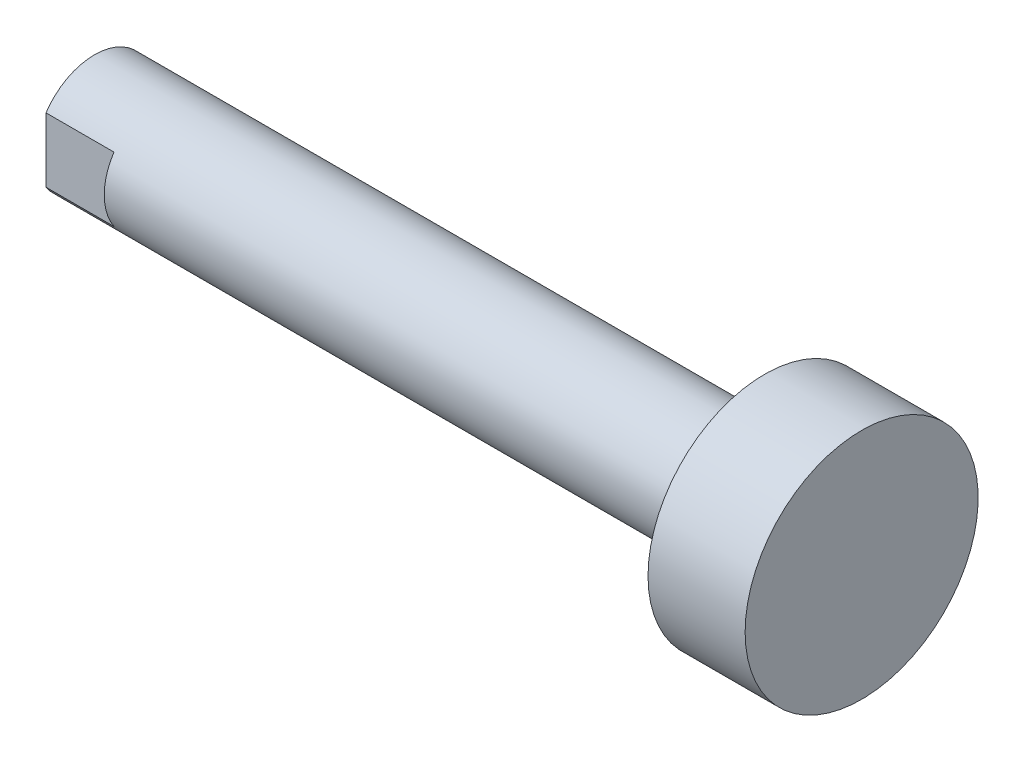
ISO-10303-21;
HEADER;
FILE_DESCRIPTION(('STEP AP214'),'2;1');
FILE_NAME('part.step','',(''),(''),'','','');
FILE_SCHEMA(('AUTOMOTIVE_DESIGN { 1 0 10303 214 1 1 1 1 }'));
ENDSEC;
DATA;
#1=APPLICATION_CONTEXT('core data for automotive mechanical design processes');
#2=APPLICATION_PROTOCOL_DEFINITION('international standard','automotive_design',2000,#1);
#3=PRODUCT_CONTEXT('',#1,'mechanical');
#4=PRODUCT('Part','Part','',(#3));
#5=PRODUCT_RELATED_PRODUCT_CATEGORY('part','',(#4));
#6=PRODUCT_DEFINITION_FORMATION('','',#4);
#7=PRODUCT_DEFINITION_CONTEXT('part definition',#1,'design');
#8=PRODUCT_DEFINITION('design','',#6,#7);
#9=PRODUCT_DEFINITION_SHAPE('','',#8);
#10=(LENGTH_UNIT() NAMED_UNIT(*) SI_UNIT(.MILLI.,.METRE.));
#11=(NAMED_UNIT(*) PLANE_ANGLE_UNIT() SI_UNIT($,.RADIAN.));
#12=(NAMED_UNIT(*) SI_UNIT($,.STERADIAN.) SOLID_ANGLE_UNIT());
#13=UNCERTAINTY_MEASURE_WITH_UNIT(LENGTH_MEASURE(1.E-05),#10,'distance_accuracy_value','');
#14=(GEOMETRIC_REPRESENTATION_CONTEXT(3) GLOBAL_UNCERTAINTY_ASSIGNED_CONTEXT((#13)) GLOBAL_UNIT_ASSIGNED_CONTEXT((#10,
#11,#12)) REPRESENTATION_CONTEXT('',''));
#15=CARTESIAN_POINT('',(0.,0.,0.));
#16=DIRECTION('',(0.,0.,1.));
#17=DIRECTION('',(1.,0.,0.));
#18=AXIS2_PLACEMENT_3D('',#15,#16,#17);
#19=CARTESIAN_POINT('',(36.,0.,0.));
#20=DIRECTION('',(-1.,0.,0.));
#21=DIRECTION('',(0.,0.,1.));
#22=AXIS2_PLACEMENT_3D('',#19,#20,#21);
#23=CYLINDRICAL_SURFACE('',#22,6.);
#24=CARTESIAN_POINT('',(36.,0.,0.));
#25=DIRECTION('',(-1.,0.,0.));
#26=DIRECTION('',(0.,0.,1.));
#27=AXIS2_PLACEMENT_3D('',#24,#25,#26);
#28=CIRCLE('',#27,6.);
#29=CARTESIAN_POINT('',(36.,0.,6.));
#30=VERTEX_POINT('',#29);
#31=EDGE_CURVE('E122',#30,#30,#28,.T.);
#32=ORIENTED_EDGE('',*,*,#31,.T.);
#33=EDGE_LOOP('',(#32));
#34=FACE_BOUND('',#33,.T.);
#35=CARTESIAN_POINT('',(31.,0.,0.));
#36=DIRECTION('',(-1.,0.,0.));
#37=DIRECTION('',(0.,0.,1.));
#38=AXIS2_PLACEMENT_3D('',#35,#36,#37);
#39=CIRCLE('',#38,6.);
#40=CARTESIAN_POINT('',(31.,0.,6.));
#41=VERTEX_POINT('',#40);
#42=EDGE_CURVE('E116',#41,#41,#39,.T.);
#43=ORIENTED_EDGE('',*,*,#42,.F.);
#44=EDGE_LOOP('',(#43));
#45=FACE_BOUND('',#44,.T.);
#46=ADVANCED_FACE('F33',(#34,#45),#23,.T.);
#47=CARTESIAN_POINT('',(36.,6.,0.));
#48=DIRECTION('',(1.,0.,0.));
#49=DIRECTION('',(0.,0.,-1.));
#50=AXIS2_PLACEMENT_3D('',#47,#48,#49);
#51=PLANE('',#50);
#52=ORIENTED_EDGE('',*,*,#31,.F.);
#53=EDGE_LOOP('',(#52));
#54=FACE_BOUND('',#53,.T.);
#55=ADVANCED_FACE('F136',(#54),#51,.T.);
#56=CARTESIAN_POINT('',(31.,0.,0.));
#57=DIRECTION('',(-1.,0.,0.));
#58=DIRECTION('',(0.,0.,1.));
#59=AXIS2_PLACEMENT_3D('',#56,#57,#58);
#60=PLANE('',#59);
#61=CARTESIAN_POINT('',(31.,0.,0.));
#62=DIRECTION('',(-1.,0.,0.));
#63=DIRECTION('',(0.,0.,1.));
#64=AXIS2_PLACEMENT_3D('',#61,#62,#63);
#65=CIRCLE('',#64,3.);
#66=CARTESIAN_POINT('',(31.,0.,3.));
#67=VERTEX_POINT('',#66);
#68=EDGE_CURVE('E111',#67,#67,#65,.T.);
#69=ORIENTED_EDGE('',*,*,#68,.F.);
#70=EDGE_LOOP('',(#69));
#71=FACE_BOUND('',#70,.T.);
#72=ORIENTED_EDGE('',*,*,#42,.T.);
#73=EDGE_LOOP('',(#72));
#74=FACE_BOUND('',#73,.T.);
#75=ADVANCED_FACE('F141',(#71,#74),#60,.T.);
#76=CARTESIAN_POINT('',(-3.5,0.,0.));
#77=DIRECTION('',(1.,0.,0.));
#78=DIRECTION('',(0.,0.,-1.));
#79=AXIS2_PLACEMENT_3D('',#76,#77,#78);
#80=CYLINDRICAL_SURFACE('',#79,3.);
#81=CARTESIAN_POINT('',(-3.5,0.,0.));
#82=DIRECTION('',(-1.,0.,0.));
#83=DIRECTION('',(0.,0.,1.));
#84=AXIS2_PLACEMENT_3D('',#81,#82,#83);
#85=CIRCLE('',#84,3.);
#86=CARTESIAN_POINT('',(-3.5,1.6583123951777,2.5));
#87=VERTEX_POINT('',#86);
#88=CARTESIAN_POINT('',(-3.5,1.6583123951777,-2.5));
#89=VERTEX_POINT('',#88);
#90=EDGE_CURVE('E117',#87,#89,#85,.T.);
#91=ORIENTED_EDGE('',*,*,#90,.F.);
#92=DIRECTION('',(-1.,0.,0.));
#93=VECTOR('',#92,1.);
#94=CARTESIAN_POINT('',(0.,1.6583123951777,2.5));
#95=LINE('',#94,#93);
#96=CARTESIAN_POINT('',(0.,1.6583123951777,2.5));
#97=VERTEX_POINT('',#96);
#98=EDGE_CURVE('E48',#97,#87,#95,.T.);
#99=ORIENTED_EDGE('',*,*,#98,.F.);
#100=CARTESIAN_POINT('',(0.,0.,0.));
#101=DIRECTION('',(-1.,0.,0.));
#102=DIRECTION('',(0.,0.,1.));
#103=AXIS2_PLACEMENT_3D('',#100,#101,#102);
#104=CIRCLE('',#103,3.);
#105=CARTESIAN_POINT('',(0.,-1.6583123951777,2.5));
#106=VERTEX_POINT('',#105);
#107=EDGE_CURVE('E90',#106,#97,#104,.T.);
#108=ORIENTED_EDGE('',*,*,#107,.F.);
#109=DIRECTION('',(-1.,0.,0.));
#110=VECTOR('',#109,1.);
#111=CARTESIAN_POINT('',(0.,-1.6583123951777,2.5));
#112=LINE('',#111,#110);
#113=CARTESIAN_POINT('',(-3.5,-1.6583123951777,2.5));
#114=VERTEX_POINT('',#113);
#115=EDGE_CURVE('E97',#106,#114,#112,.T.);
#116=ORIENTED_EDGE('',*,*,#115,.T.);
#117=CARTESIAN_POINT('',(-3.5,-1.6583123951777,-2.5));
#118=VERTEX_POINT('',#117);
#119=EDGE_CURVE('E113',#118,#114,#85,.T.);
#120=ORIENTED_EDGE('',*,*,#119,.F.);
#121=DIRECTION('',(-1.,0.,0.));
#122=VECTOR('',#121,1.);
#123=CARTESIAN_POINT('',(0.,-1.6583123951777,-2.5));
#124=LINE('',#123,#122);
#125=CARTESIAN_POINT('',(0.,-1.6583123951777,-2.5));
#126=VERTEX_POINT('',#125);
#127=EDGE_CURVE('E56',#126,#118,#124,.T.);
#128=ORIENTED_EDGE('',*,*,#127,.F.);
#129=CARTESIAN_POINT('',(0.,0.,0.));
#130=DIRECTION('',(-1.,0.,0.));
#131=DIRECTION('',(0.,0.,1.));
#132=AXIS2_PLACEMENT_3D('',#129,#130,#131);
#133=CIRCLE('',#132,3.);
#134=CARTESIAN_POINT('',(0.,1.6583123951777,-2.5));
#135=VERTEX_POINT('',#134);
#136=EDGE_CURVE('E102',#135,#126,#133,.T.);
#137=ORIENTED_EDGE('',*,*,#136,.F.);
#138=DIRECTION('',(-1.,0.,0.));
#139=VECTOR('',#138,1.);
#140=CARTESIAN_POINT('',(0.,1.6583123951777,-2.5));
#141=LINE('',#140,#139);
#142=EDGE_CURVE('E108',#135,#89,#141,.T.);
#143=ORIENTED_EDGE('',*,*,#142,.T.);
#144=EDGE_LOOP('',(#91,#99,#108,#116,#120,#128,#137,#143));
#145=FACE_BOUND('',#144,.T.);
#146=ORIENTED_EDGE('',*,*,#68,.T.);
#147=EDGE_LOOP('',(#146));
#148=FACE_BOUND('',#147,.T.);
#149=ADVANCED_FACE('F148',(#145,#148),#80,.T.);
#150=CARTESIAN_POINT('',(-3.5,0.,0.));
#151=DIRECTION('',(-1.,0.,0.));
#152=DIRECTION('',(0.,0.,1.));
#153=AXIS2_PLACEMENT_3D('',#150,#151,#152);
#154=PLANE('',#153);
#155=CARTESIAN_POINT('',(-3.5,0.,0.));
#156=DIRECTION('',(-1.,0.,0.));
#157=DIRECTION('',(0.,0.,1.));
#158=AXIS2_PLACEMENT_3D('',#155,#156,#157);
#159=CIRCLE('',#158,1.50000000000062);
#160=CARTESIAN_POINT('',(-3.5,0.,1.50000000000062));
#161=VERTEX_POINT('',#160);
#162=EDGE_CURVE('E11',#161,#161,#159,.F.);
#163=ORIENTED_EDGE('',*,*,#162,.T.);
#164=EDGE_LOOP('',(#163));
#165=FACE_BOUND('',#164,.T.);
#166=DIRECTION('',(0.,-1.,0.));
#167=VECTOR('',#166,1.);
#168=CARTESIAN_POINT('',(-3.5,1.6583123951777,2.5));
#169=LINE('',#168,#167);
#170=EDGE_CURVE('E88',#87,#114,#169,.T.);
#171=ORIENTED_EDGE('',*,*,#170,.F.);
#172=ORIENTED_EDGE('',*,*,#90,.T.);
#173=DIRECTION('',(0.,1.,0.));
#174=VECTOR('',#173,1.);
#175=CARTESIAN_POINT('',(-3.5,-1.6583123951777,-2.5));
#176=LINE('',#175,#174);
#177=EDGE_CURVE('E100',#118,#89,#176,.T.);
#178=ORIENTED_EDGE('',*,*,#177,.F.);
#179=ORIENTED_EDGE('',*,*,#119,.T.);
#180=EDGE_LOOP('',(#171,#172,#178,#179));
#181=FACE_BOUND('',#180,.T.);
#182=ADVANCED_FACE('F152',(#165,#181),#154,.T.);
#183=CARTESIAN_POINT('',(0.,-1.6583123951777,-2.5));
#184=DIRECTION('',(0.,0.,1.));
#185=DIRECTION('',(1.,0.,0.));
#186=AXIS2_PLACEMENT_3D('',#183,#184,#185);
#187=PLANE('',#186);
#188=ORIENTED_EDGE('',*,*,#177,.T.);
#189=ORIENTED_EDGE('',*,*,#142,.F.);
#190=DIRECTION('',(0.,1.,0.));
#191=VECTOR('',#190,1.);
#192=CARTESIAN_POINT('',(0.,-1.6583123951777,-2.5));
#193=LINE('',#192,#191);
#194=EDGE_CURVE('E104',#126,#135,#193,.T.);
#195=ORIENTED_EDGE('',*,*,#194,.F.);
#196=ORIENTED_EDGE('',*,*,#127,.T.);
#197=EDGE_LOOP('',(#188,#189,#195,#196));
#198=FACE_BOUND('',#197,.T.);
#199=ADVANCED_FACE('F156',(#198),#187,.F.);
#200=CARTESIAN_POINT('',(0.,0.,0.));
#201=DIRECTION('',(-1.,0.,0.));
#202=DIRECTION('',(0.,0.,1.));
#203=AXIS2_PLACEMENT_3D('',#200,#201,#202);
#204=PLANE('',#203);
#205=ORIENTED_EDGE('',*,*,#136,.T.);
#206=ORIENTED_EDGE('',*,*,#194,.T.);
#207=EDGE_LOOP('',(#205,#206));
#208=FACE_BOUND('',#207,.T.);
#209=ADVANCED_FACE('F160',(#208),#204,.T.);
#210=CARTESIAN_POINT('',(0.,1.6583123951777,2.5));
#211=DIRECTION('',(0.,0.,-1.));
#212=DIRECTION('',(-1.,0.,0.));
#213=AXIS2_PLACEMENT_3D('',#210,#211,#212);
#214=PLANE('',#213);
#215=ORIENTED_EDGE('',*,*,#170,.T.);
#216=ORIENTED_EDGE('',*,*,#115,.F.);
#217=DIRECTION('',(0.,-1.,0.));
#218=VECTOR('',#217,1.);
#219=CARTESIAN_POINT('',(0.,1.6583123951777,2.5));
#220=LINE('',#219,#218);
#221=EDGE_CURVE('E94',#97,#106,#220,.T.);
#222=ORIENTED_EDGE('',*,*,#221,.F.);
#223=ORIENTED_EDGE('',*,*,#98,.T.);
#224=EDGE_LOOP('',(#215,#216,#222,#223));
#225=FACE_BOUND('',#224,.T.);
#226=ADVANCED_FACE('F163',(#225),#214,.F.);
#227=CARTESIAN_POINT('',(0.,0.,0.));
#228=DIRECTION('',(-1.,0.,0.));
#229=DIRECTION('',(0.,0.,1.));
#230=AXIS2_PLACEMENT_3D('',#227,#228,#229);
#231=PLANE('',#230);
#232=ORIENTED_EDGE('',*,*,#107,.T.);
#233=ORIENTED_EDGE('',*,*,#221,.T.);
#234=EDGE_LOOP('',(#232,#233));
#235=FACE_BOUND('',#234,.T.);
#236=ADVANCED_FACE('F82',(#235),#231,.T.);
#237=CARTESIAN_POINT('',(2.5,0.,0.));
#238=DIRECTION('',(-1.,0.,0.));
#239=DIRECTION('',(0.,0.,1.));
#240=AXIS2_PLACEMENT_3D('',#237,#238,#239);
#241=CONICAL_SURFACE('',#240,1.22949999999999,1.0471975512);
#242=CARTESIAN_POINT('',(3.20985215596306,0.,0.));
#243=VERTEX_POINT('',#242);
#244=VERTEX_LOOP('',#243);
#245=FACE_BOUND('',#244,.T.);
#246=CARTESIAN_POINT('',(2.5,0.,0.));
#247=DIRECTION('',(-1.,0.,0.));
#248=DIRECTION('',(0.,0.,1.));
#249=AXIS2_PLACEMENT_3D('',#246,#247,#248);
#250=CIRCLE('',#249,1.22949999999999);
#251=CARTESIAN_POINT('',(2.5,0.,1.22949999999999));
#252=VERTEX_POINT('',#251);
#253=EDGE_CURVE('E86',#252,#252,#250,.T.);
#254=ORIENTED_EDGE('',*,*,#253,.T.);
#255=EDGE_LOOP('',(#254));
#256=FACE_BOUND('',#255,.T.);
#257=ADVANCED_FACE('F78',(#245,#256),#241,.F.);
#258=CARTESIAN_POINT('',(-3.5,0.,0.));
#259=DIRECTION('',(-1.,0.,0.));
#260=DIRECTION('',(0.,0.,1.));
#261=AXIS2_PLACEMENT_3D('',#258,#259,#260);
#262=CYLINDRICAL_SURFACE('',#261,1.22949999999999);
#263=CARTESIAN_POINT('',(-3.22950000000075,0.,0.));
#264=DIRECTION('',(-1.,0.,0.));
#265=DIRECTION('',(0.,0.,1.));
#266=AXIS2_PLACEMENT_3D('',#263,#264,#265);
#267=CIRCLE('',#266,1.22949999999999);
#268=CARTESIAN_POINT('',(-3.22950000000075,0.,1.22949999999999));
#269=VERTEX_POINT('',#268);
#270=EDGE_CURVE('E41',#269,#269,#267,.T.);
#271=ORIENTED_EDGE('',*,*,#270,.T.);
#272=EDGE_LOOP('',(#271));
#273=FACE_BOUND('',#272,.T.);
#274=ORIENTED_EDGE('',*,*,#253,.F.);
#275=EDGE_LOOP('',(#274));
#276=FACE_BOUND('',#275,.T.);
#277=ADVANCED_FACE('F81',(#273,#276),#262,.F.);
#278=CARTESIAN_POINT('',(-3.22950000000075,0.,0.));
#279=DIRECTION('',(-1.,0.,0.));
#280=DIRECTION('',(0.,0.,1.));
#281=AXIS2_PLACEMENT_3D('',#278,#279,#280);
#282=CONICAL_SURFACE('',#281,1.22949999999999,0.785398163400002);
#283=ORIENTED_EDGE('',*,*,#162,.F.);
#284=EDGE_LOOP('',(#283));
#285=FACE_BOUND('',#284,.T.);
#286=ORIENTED_EDGE('',*,*,#270,.F.);
#287=EDGE_LOOP('',(#286));
#288=FACE_BOUND('',#287,.T.);
#289=ADVANCED_FACE('F35',(#285,#288),#282,.F.);
#290=CLOSED_SHELL('',(#46,#55,#75,#149,#182,#199,#209,#226,#236,#257,#277,#289));
#291=MANIFOLD_SOLID_BREP('B2',#290);
#292=ADVANCED_BREP_SHAPE_REPRESENTATION('',(#18,#291),#14);
#293=SHAPE_DEFINITION_REPRESENTATION(#9,#292);
ENDSEC;
END-ISO-10303-21;
